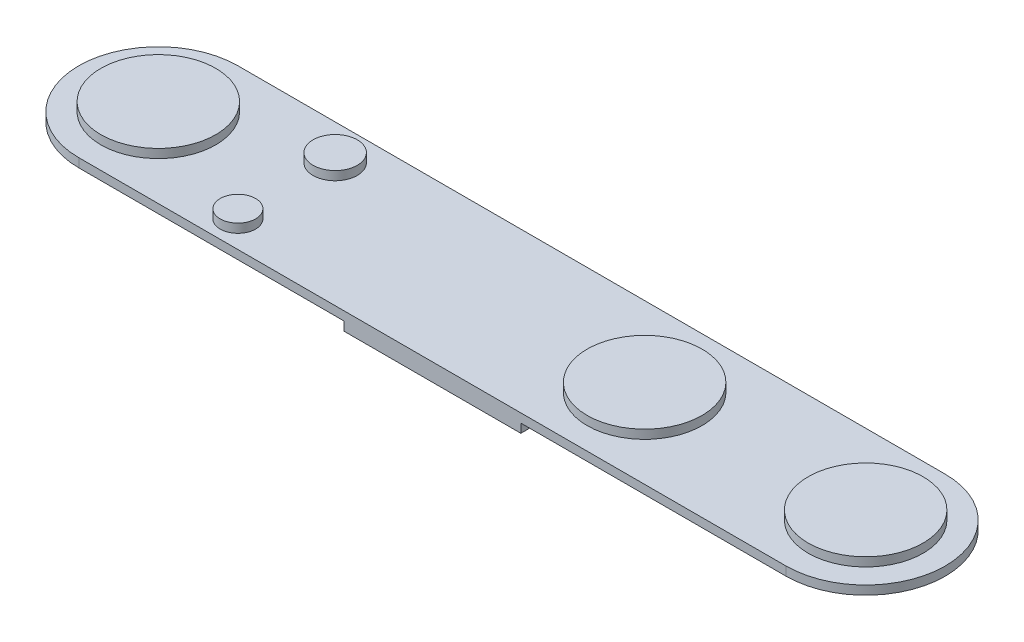
ISO-10303-21;
HEADER;
FILE_DESCRIPTION(('STEP AP214'),'2;1');
FILE_NAME('part.step','',(''),(''),'','','');
FILE_SCHEMA(('AUTOMOTIVE_DESIGN { 1 0 10303 214 1 1 1 1 }'));
ENDSEC;
DATA;
#1=APPLICATION_CONTEXT('core data for automotive mechanical design processes');
#2=APPLICATION_PROTOCOL_DEFINITION('international standard','automotive_design',2000,#1);
#3=PRODUCT_CONTEXT('',#1,'mechanical');
#4=PRODUCT('Part','Part','',(#3));
#5=PRODUCT_RELATED_PRODUCT_CATEGORY('part','',(#4));
#6=PRODUCT_DEFINITION_FORMATION('','',#4);
#7=PRODUCT_DEFINITION_CONTEXT('part definition',#1,'design');
#8=PRODUCT_DEFINITION('design','',#6,#7);
#9=PRODUCT_DEFINITION_SHAPE('','',#8);
#10=(LENGTH_UNIT() NAMED_UNIT(*) SI_UNIT(.MILLI.,.METRE.));
#11=(NAMED_UNIT(*) PLANE_ANGLE_UNIT() SI_UNIT($,.RADIAN.));
#12=(NAMED_UNIT(*) SI_UNIT($,.STERADIAN.) SOLID_ANGLE_UNIT());
#13=UNCERTAINTY_MEASURE_WITH_UNIT(LENGTH_MEASURE(1.E-05),#10,'distance_accuracy_value','');
#14=(GEOMETRIC_REPRESENTATION_CONTEXT(3) GLOBAL_UNCERTAINTY_ASSIGNED_CONTEXT((#13)) GLOBAL_UNIT_ASSIGNED_CONTEXT((#10,
#11,#12)) REPRESENTATION_CONTEXT('',''));
#15=CARTESIAN_POINT('',(0.,0.,0.));
#16=DIRECTION('',(0.,0.,1.));
#17=DIRECTION('',(1.,0.,0.));
#18=AXIS2_PLACEMENT_3D('',#15,#16,#17);
#19=CARTESIAN_POINT('',(-40.,0.,0.));
#20=DIRECTION('',(0.,1.,0.));
#21=DIRECTION('',(0.,0.,1.));
#22=AXIS2_PLACEMENT_3D('',#19,#20,#21);
#23=PLANE('',#22);
#24=DIRECTION('',(0.,0.,1.));
#25=VECTOR('',#24,1.);
#26=CARTESIAN_POINT('',(10.,0.,-9.));
#27=LINE('',#26,#25);
#28=CARTESIAN_POINT('',(10.,0.,-9.00000000000001));
#29=VERTEX_POINT('',#28);
#30=CARTESIAN_POINT('',(10.,0.,8.99999999999999));
#31=VERTEX_POINT('',#30);
#32=EDGE_CURVE('E132',#29,#31,#27,.T.);
#33=ORIENTED_EDGE('',*,*,#32,.F.);
#34=DIRECTION('',(-1.,0.,0.));
#35=VECTOR('',#34,1.);
#36=CARTESIAN_POINT('',(-40.,0.,-9.));
#37=LINE('',#36,#35);
#38=CARTESIAN_POINT('',(40.,0.,-9.00000000000002));
#39=VERTEX_POINT('',#38);
#40=EDGE_CURVE('E186',#39,#29,#37,.T.);
#41=ORIENTED_EDGE('',*,*,#40,.F.);
#42=CARTESIAN_POINT('',(40.,0.,0.));
#43=DIRECTION('',(0.,1.,0.));
#44=DIRECTION('',(0.,0.,1.));
#45=AXIS2_PLACEMENT_3D('',#42,#43,#44);
#46=CIRCLE('',#45,9.);
#47=CARTESIAN_POINT('',(40.,0.,9.));
#48=VERTEX_POINT('',#47);
#49=EDGE_CURVE('E202',#48,#39,#46,.T.);
#50=ORIENTED_EDGE('',*,*,#49,.F.);
#51=DIRECTION('',(1.,0.,0.));
#52=VECTOR('',#51,1.);
#53=CARTESIAN_POINT('',(-40.,0.,9.));
#54=LINE('',#53,#52);
#55=EDGE_CURVE('E59',#31,#48,#54,.T.);
#56=ORIENTED_EDGE('',*,*,#55,.F.);
#57=EDGE_LOOP('',(#33,#41,#50,#56));
#58=FACE_BOUND('',#57,.T.);
#59=ADVANCED_FACE('F43',(#58),#23,.F.);
#60=DIRECTION('',(0.,0.,-1.));
#61=VECTOR('',#60,1.);
#62=CARTESIAN_POINT('',(-10.,0.,-9.));
#63=LINE('',#62,#61);
#64=CARTESIAN_POINT('',(-10.,0.,9.));
#65=VERTEX_POINT('',#64);
#66=CARTESIAN_POINT('',(-10.,0.,-9.));
#67=VERTEX_POINT('',#66);
#68=EDGE_CURVE('E67',#65,#67,#63,.T.);
#69=ORIENTED_EDGE('',*,*,#68,.F.);
#70=CARTESIAN_POINT('',(-40.,0.,9.));
#71=VERTEX_POINT('',#70);
#72=EDGE_CURVE('E199',#71,#65,#54,.T.);
#73=ORIENTED_EDGE('',*,*,#72,.F.);
#74=CARTESIAN_POINT('',(-40.,0.,0.));
#75=DIRECTION('',(0.,1.,0.));
#76=DIRECTION('',(0.,0.,1.));
#77=AXIS2_PLACEMENT_3D('',#74,#75,#76);
#78=CIRCLE('',#77,9.);
#79=CARTESIAN_POINT('',(-40.,0.,-9.));
#80=VERTEX_POINT('',#79);
#81=EDGE_CURVE('E177',#80,#71,#78,.T.);
#82=ORIENTED_EDGE('',*,*,#81,.F.);
#83=EDGE_CURVE('E205',#67,#80,#37,.T.);
#84=ORIENTED_EDGE('',*,*,#83,.F.);
#85=EDGE_LOOP('',(#69,#73,#82,#84));
#86=FACE_BOUND('',#85,.T.);
#87=ADVANCED_FACE('F248',(#86),#23,.F.);
#88=CARTESIAN_POINT('',(-40.,1.,0.));
#89=DIRECTION('',(0.,-1.,0.));
#90=DIRECTION('',(0.,0.,-1.));
#91=AXIS2_PLACEMENT_3D('',#88,#89,#90);
#92=CYLINDRICAL_SURFACE('',#91,9.);
#93=ORIENTED_EDGE('',*,*,#81,.T.);
#94=DIRECTION('',(0.,-1.,0.));
#95=VECTOR('',#94,1.);
#96=CARTESIAN_POINT('',(-40.,1.,9.));
#97=LINE('',#96,#95);
#98=CARTESIAN_POINT('',(-40.,1.,9.));
#99=VERTEX_POINT('',#98);
#100=EDGE_CURVE('E11',#99,#71,#97,.T.);
#101=ORIENTED_EDGE('',*,*,#100,.F.);
#102=CARTESIAN_POINT('',(-40.,1.,0.));
#103=DIRECTION('',(0.,1.,0.));
#104=DIRECTION('',(0.,0.,1.));
#105=AXIS2_PLACEMENT_3D('',#102,#103,#104);
#106=CIRCLE('',#105,9.);
#107=CARTESIAN_POINT('',(-40.,1.,-9.));
#108=VERTEX_POINT('',#107);
#109=EDGE_CURVE('E181',#108,#99,#106,.T.);
#110=ORIENTED_EDGE('',*,*,#109,.F.);
#111=DIRECTION('',(0.,-1.,0.));
#112=VECTOR('',#111,1.);
#113=CARTESIAN_POINT('',(-40.,1.,-9.));
#114=LINE('',#113,#112);
#115=EDGE_CURVE('E195',#108,#80,#114,.T.);
#116=ORIENTED_EDGE('',*,*,#115,.T.);
#117=EDGE_LOOP('',(#93,#101,#110,#116));
#118=FACE_BOUND('',#117,.T.);
#119=ADVANCED_FACE('F45',(#118),#92,.T.);
#120=CARTESIAN_POINT('',(-40.,1.,9.));
#121=DIRECTION('',(0.,0.,-1.));
#122=DIRECTION('',(-1.,0.,0.));
#123=AXIS2_PLACEMENT_3D('',#120,#121,#122);
#124=PLANE('',#123);
#125=ORIENTED_EDGE('',*,*,#72,.T.);
#126=DIRECTION('',(0.,1.,0.));
#127=VECTOR('',#126,1.);
#128=CARTESIAN_POINT('',(-10.,-1.,9.));
#129=LINE('',#128,#127);
#130=CARTESIAN_POINT('',(-10.,-1.,9.));
#131=VERTEX_POINT('',#130);
#132=EDGE_CURVE('E115',#131,#65,#129,.T.);
#133=ORIENTED_EDGE('',*,*,#132,.F.);
#134=DIRECTION('',(-1.,0.,0.));
#135=VECTOR('',#134,1.);
#136=CARTESIAN_POINT('',(-10.,-1.,9.));
#137=LINE('',#136,#135);
#138=CARTESIAN_POINT('',(10.,-1.,9.));
#139=VERTEX_POINT('',#138);
#140=EDGE_CURVE('E108',#139,#131,#137,.T.);
#141=ORIENTED_EDGE('',*,*,#140,.F.);
#142=DIRECTION('',(0.,1.,0.));
#143=VECTOR('',#142,1.);
#144=CARTESIAN_POINT('',(10.,-1.,9.));
#145=LINE('',#144,#143);
#146=EDGE_CURVE('E112',#139,#31,#145,.T.);
#147=ORIENTED_EDGE('',*,*,#146,.T.);
#148=ORIENTED_EDGE('',*,*,#55,.T.);
#149=DIRECTION('',(0.,-1.,0.));
#150=VECTOR('',#149,1.);
#151=CARTESIAN_POINT('',(40.,1.,9.));
#152=LINE('',#151,#150);
#153=CARTESIAN_POINT('',(40.,1.,9.));
#154=VERTEX_POINT('',#153);
#155=EDGE_CURVE('E52',#154,#48,#152,.T.);
#156=ORIENTED_EDGE('',*,*,#155,.F.);
#157=DIRECTION('',(1.,0.,0.));
#158=VECTOR('',#157,1.);
#159=CARTESIAN_POINT('',(-40.,1.,9.));
#160=LINE('',#159,#158);
#161=EDGE_CURVE('E185',#99,#154,#160,.T.);
#162=ORIENTED_EDGE('',*,*,#161,.F.);
#163=ORIENTED_EDGE('',*,*,#100,.T.);
#164=EDGE_LOOP('',(#125,#133,#141,#147,#148,#156,#162,#163));
#165=FACE_BOUND('',#164,.T.);
#166=ADVANCED_FACE('F110',(#165),#124,.F.);
#167=CARTESIAN_POINT('',(40.,1.,0.));
#168=DIRECTION('',(0.,-1.,0.));
#169=DIRECTION('',(0.,0.,-1.));
#170=AXIS2_PLACEMENT_3D('',#167,#168,#169);
#171=CYLINDRICAL_SURFACE('',#170,9.);
#172=ORIENTED_EDGE('',*,*,#49,.T.);
#173=DIRECTION('',(0.,-1.,0.));
#174=VECTOR('',#173,1.);
#175=CARTESIAN_POINT('',(40.,1.,-9.00000000000002));
#176=LINE('',#175,#174);
#177=CARTESIAN_POINT('',(40.,1.,-9.00000000000002));
#178=VERTEX_POINT('',#177);
#179=EDGE_CURVE('E212',#178,#39,#176,.T.);
#180=ORIENTED_EDGE('',*,*,#179,.F.);
#181=CARTESIAN_POINT('',(40.,1.,0.));
#182=DIRECTION('',(0.,1.,0.));
#183=DIRECTION('',(0.,0.,1.));
#184=AXIS2_PLACEMENT_3D('',#181,#182,#183);
#185=CIRCLE('',#184,9.);
#186=EDGE_CURVE('E189',#154,#178,#185,.T.);
#187=ORIENTED_EDGE('',*,*,#186,.F.);
#188=ORIENTED_EDGE('',*,*,#155,.T.);
#189=EDGE_LOOP('',(#172,#180,#187,#188));
#190=FACE_BOUND('',#189,.T.);
#191=ADVANCED_FACE('F220',(#190),#171,.T.);
#192=CARTESIAN_POINT('',(-40.,1.,-9.));
#193=DIRECTION('',(0.,0.,1.));
#194=DIRECTION('',(1.,0.,0.));
#195=AXIS2_PLACEMENT_3D('',#192,#193,#194);
#196=PLANE('',#195);
#197=ORIENTED_EDGE('',*,*,#40,.T.);
#198=DIRECTION('',(0.,1.,0.));
#199=VECTOR('',#198,1.);
#200=CARTESIAN_POINT('',(10.,-1.,-9.));
#201=LINE('',#200,#199);
#202=CARTESIAN_POINT('',(10.,-1.,-9.));
#203=VERTEX_POINT('',#202);
#204=EDGE_CURVE('E225',#203,#29,#201,.T.);
#205=ORIENTED_EDGE('',*,*,#204,.F.);
#206=DIRECTION('',(1.,0.,0.));
#207=VECTOR('',#206,1.);
#208=CARTESIAN_POINT('',(-10.,-1.,-9.));
#209=LINE('',#208,#207);
#210=CARTESIAN_POINT('',(-10.,-1.,-9.));
#211=VERTEX_POINT('',#210);
#212=EDGE_CURVE('E125',#211,#203,#209,.T.);
#213=ORIENTED_EDGE('',*,*,#212,.F.);
#214=DIRECTION('',(0.,1.,0.));
#215=VECTOR('',#214,1.);
#216=CARTESIAN_POINT('',(-10.,-1.,-9.));
#217=LINE('',#216,#215);
#218=EDGE_CURVE('E141',#211,#67,#217,.T.);
#219=ORIENTED_EDGE('',*,*,#218,.T.);
#220=ORIENTED_EDGE('',*,*,#83,.T.);
#221=ORIENTED_EDGE('',*,*,#115,.F.);
#222=DIRECTION('',(-1.,0.,0.));
#223=VECTOR('',#222,1.);
#224=CARTESIAN_POINT('',(-40.,1.,-9.));
#225=LINE('',#224,#223);
#226=EDGE_CURVE('E192',#178,#108,#225,.T.);
#227=ORIENTED_EDGE('',*,*,#226,.F.);
#228=ORIENTED_EDGE('',*,*,#179,.T.);
#229=EDGE_LOOP('',(#197,#205,#213,#219,#220,#221,#227,#228));
#230=FACE_BOUND('',#229,.T.);
#231=ADVANCED_FACE('F224',(#230),#196,.F.);
#232=CARTESIAN_POINT('',(-40.,1.,0.));
#233=DIRECTION('',(0.,1.,0.));
#234=DIRECTION('',(0.,0.,1.));
#235=AXIS2_PLACEMENT_3D('',#232,#233,#234);
#236=PLANE('',#235);
#237=CARTESIAN_POINT('',(40.,1.,0.));
#238=DIRECTION('',(0.,1.,0.));
#239=DIRECTION('',(0.,0.,1.));
#240=AXIS2_PLACEMENT_3D('',#237,#238,#239);
#241=CIRCLE('',#240,6.5);
#242=CARTESIAN_POINT('',(40.,1.,6.5));
#243=VERTEX_POINT('',#242);
#244=EDGE_CURVE('E139',#243,#243,#241,.T.);
#245=ORIENTED_EDGE('',*,*,#244,.F.);
#246=EDGE_LOOP('',(#245));
#247=FACE_BOUND('',#246,.T.);
#248=CARTESIAN_POINT('',(-40.,1.,0.));
#249=DIRECTION('',(0.,1.,0.));
#250=DIRECTION('',(0.,0.,1.));
#251=AXIS2_PLACEMENT_3D('',#248,#249,#250);
#252=CIRCLE('',#251,6.5);
#253=CARTESIAN_POINT('',(-40.,1.,6.5));
#254=VERTEX_POINT('',#253);
#255=EDGE_CURVE('E149',#254,#254,#252,.T.);
#256=ORIENTED_EDGE('',*,*,#255,.F.);
#257=EDGE_LOOP('',(#256));
#258=FACE_BOUND('',#257,.T.);
#259=CARTESIAN_POINT('',(15.,1.,0.));
#260=DIRECTION('',(0.,1.,0.));
#261=DIRECTION('',(0.,0.,1.));
#262=AXIS2_PLACEMENT_3D('',#259,#260,#261);
#263=CIRCLE('',#262,6.5);
#264=CARTESIAN_POINT('',(15.,1.,6.5));
#265=VERTEX_POINT('',#264);
#266=EDGE_CURVE('E157',#265,#265,#263,.T.);
#267=ORIENTED_EDGE('',*,*,#266,.F.);
#268=EDGE_LOOP('',(#267));
#269=FACE_BOUND('',#268,.T.);
#270=CARTESIAN_POINT('',(-25.,1.,6.));
#271=DIRECTION('',(0.,1.,0.));
#272=DIRECTION('',(0.,0.,1.));
#273=AXIS2_PLACEMENT_3D('',#270,#271,#272);
#274=CIRCLE('',#273,2.);
#275=CARTESIAN_POINT('',(-25.,1.,8.00000000000001));
#276=VERTEX_POINT('',#275);
#277=EDGE_CURVE('E165',#276,#276,#274,.T.);
#278=ORIENTED_EDGE('',*,*,#277,.F.);
#279=EDGE_LOOP('',(#278));
#280=FACE_BOUND('',#279,.T.);
#281=CARTESIAN_POINT('',(-25.,1.,-5.00000000000002));
#282=DIRECTION('',(0.,1.,0.));
#283=DIRECTION('',(0.,0.,1.));
#284=AXIS2_PLACEMENT_3D('',#281,#282,#283);
#285=CIRCLE('',#284,2.5);
#286=CARTESIAN_POINT('',(-25.,1.,-2.50000000000002));
#287=VERTEX_POINT('',#286);
#288=EDGE_CURVE('E169',#287,#287,#285,.T.);
#289=ORIENTED_EDGE('',*,*,#288,.F.);
#290=EDGE_LOOP('',(#289));
#291=FACE_BOUND('',#290,.T.);
#292=ORIENTED_EDGE('',*,*,#109,.T.);
#293=ORIENTED_EDGE('',*,*,#161,.T.);
#294=ORIENTED_EDGE('',*,*,#186,.T.);
#295=ORIENTED_EDGE('',*,*,#226,.T.);
#296=EDGE_LOOP('',(#292,#293,#294,#295));
#297=FACE_BOUND('',#296,.T.);
#298=ADVANCED_FACE('F250',(#247,#258,#269,#280,#291,#297),#236,.T.);
#299=CARTESIAN_POINT('',(-25.,2.,-5.00000000000002));
#300=DIRECTION('',(0.,-1.,0.));
#301=DIRECTION('',(0.,0.,-1.));
#302=AXIS2_PLACEMENT_3D('',#299,#300,#301);
#303=CYLINDRICAL_SURFACE('',#302,2.5);
#304=CARTESIAN_POINT('',(-25.,2.,-5.00000000000002));
#305=DIRECTION('',(0.,1.,0.));
#306=DIRECTION('',(0.,0.,1.));
#307=AXIS2_PLACEMENT_3D('',#304,#305,#306);
#308=CIRCLE('',#307,2.5);
#309=CARTESIAN_POINT('',(-25.,2.,-2.50000000000002));
#310=VERTEX_POINT('',#309);
#311=EDGE_CURVE('E173',#310,#310,#308,.T.);
#312=ORIENTED_EDGE('',*,*,#311,.F.);
#313=EDGE_LOOP('',(#312));
#314=FACE_BOUND('',#313,.T.);
#315=ORIENTED_EDGE('',*,*,#288,.T.);
#316=EDGE_LOOP('',(#315));
#317=FACE_BOUND('',#316,.T.);
#318=ADVANCED_FACE('F252',(#314,#317),#303,.T.);
#319=CARTESIAN_POINT('',(-25.,2.,-5.00000000000002));
#320=DIRECTION('',(0.,1.,0.));
#321=DIRECTION('',(0.,0.,1.));
#322=AXIS2_PLACEMENT_3D('',#319,#320,#321);
#323=PLANE('',#322);
#324=ORIENTED_EDGE('',*,*,#311,.T.);
#325=EDGE_LOOP('',(#324));
#326=FACE_BOUND('',#325,.T.);
#327=ADVANCED_FACE('F259',(#326),#323,.T.);
#328=CARTESIAN_POINT('',(-25.,2.,6.));
#329=DIRECTION('',(0.,-1.,0.));
#330=DIRECTION('',(0.,0.,-1.));
#331=AXIS2_PLACEMENT_3D('',#328,#329,#330);
#332=CYLINDRICAL_SURFACE('',#331,2.);
#333=CARTESIAN_POINT('',(-25.,2.,6.));
#334=DIRECTION('',(0.,1.,0.));
#335=DIRECTION('',(0.,0.,1.));
#336=AXIS2_PLACEMENT_3D('',#333,#334,#335);
#337=CIRCLE('',#336,2.);
#338=CARTESIAN_POINT('',(-25.,2.,8.00000000000001));
#339=VERTEX_POINT('',#338);
#340=EDGE_CURVE('E161',#339,#339,#337,.T.);
#341=ORIENTED_EDGE('',*,*,#340,.F.);
#342=EDGE_LOOP('',(#341));
#343=FACE_BOUND('',#342,.T.);
#344=ORIENTED_EDGE('',*,*,#277,.T.);
#345=EDGE_LOOP('',(#344));
#346=FACE_BOUND('',#345,.T.);
#347=ADVANCED_FACE('F308',(#343,#346),#332,.T.);
#348=CARTESIAN_POINT('',(-25.,2.,6.));
#349=DIRECTION('',(0.,1.,0.));
#350=DIRECTION('',(0.,0.,1.));
#351=AXIS2_PLACEMENT_3D('',#348,#349,#350);
#352=PLANE('',#351);
#353=ORIENTED_EDGE('',*,*,#340,.T.);
#354=EDGE_LOOP('',(#353));
#355=FACE_BOUND('',#354,.T.);
#356=ADVANCED_FACE('F319',(#355),#352,.T.);
#357=CARTESIAN_POINT('',(15.,2.,0.));
#358=DIRECTION('',(0.,-1.,0.));
#359=DIRECTION('',(0.,0.,-1.));
#360=AXIS2_PLACEMENT_3D('',#357,#358,#359);
#361=CYLINDRICAL_SURFACE('',#360,6.5);
#362=CARTESIAN_POINT('',(15.,2.,0.));
#363=DIRECTION('',(0.,1.,0.));
#364=DIRECTION('',(0.,0.,1.));
#365=AXIS2_PLACEMENT_3D('',#362,#363,#364);
#366=CIRCLE('',#365,6.5);
#367=CARTESIAN_POINT('',(15.,2.,6.5));
#368=VERTEX_POINT('',#367);
#369=EDGE_CURVE('E153',#368,#368,#366,.T.);
#370=ORIENTED_EDGE('',*,*,#369,.F.);
#371=EDGE_LOOP('',(#370));
#372=FACE_BOUND('',#371,.T.);
#373=ORIENTED_EDGE('',*,*,#266,.T.);
#374=EDGE_LOOP('',(#373));
#375=FACE_BOUND('',#374,.T.);
#376=ADVANCED_FACE('F330',(#372,#375),#361,.T.);
#377=CARTESIAN_POINT('',(15.,2.,0.));
#378=DIRECTION('',(0.,1.,0.));
#379=DIRECTION('',(0.,0.,1.));
#380=AXIS2_PLACEMENT_3D('',#377,#378,#379);
#381=PLANE('',#380);
#382=ORIENTED_EDGE('',*,*,#369,.T.);
#383=EDGE_LOOP('',(#382));
#384=FACE_BOUND('',#383,.T.);
#385=ADVANCED_FACE('F341',(#384),#381,.T.);
#386=CARTESIAN_POINT('',(-40.,2.,0.));
#387=DIRECTION('',(0.,-1.,0.));
#388=DIRECTION('',(0.,0.,-1.));
#389=AXIS2_PLACEMENT_3D('',#386,#387,#388);
#390=CYLINDRICAL_SURFACE('',#389,6.5);
#391=CARTESIAN_POINT('',(-40.,2.,0.));
#392=DIRECTION('',(0.,1.,0.));
#393=DIRECTION('',(0.,0.,1.));
#394=AXIS2_PLACEMENT_3D('',#391,#392,#393);
#395=CIRCLE('',#394,6.5);
#396=CARTESIAN_POINT('',(-40.,2.,6.5));
#397=VERTEX_POINT('',#396);
#398=EDGE_CURVE('E147',#397,#397,#395,.T.);
#399=ORIENTED_EDGE('',*,*,#398,.F.);
#400=EDGE_LOOP('',(#399));
#401=FACE_BOUND('',#400,.T.);
#402=ORIENTED_EDGE('',*,*,#255,.T.);
#403=EDGE_LOOP('',(#402));
#404=FACE_BOUND('',#403,.T.);
#405=ADVANCED_FACE('F352',(#401,#404),#390,.T.);
#406=CARTESIAN_POINT('',(-40.,2.,0.));
#407=DIRECTION('',(0.,1.,0.));
#408=DIRECTION('',(0.,0.,1.));
#409=AXIS2_PLACEMENT_3D('',#406,#407,#408);
#410=PLANE('',#409);
#411=ORIENTED_EDGE('',*,*,#398,.T.);
#412=EDGE_LOOP('',(#411));
#413=FACE_BOUND('',#412,.T.);
#414=ADVANCED_FACE('F363',(#413),#410,.T.);
#415=CARTESIAN_POINT('',(40.,2.,0.));
#416=DIRECTION('',(0.,-1.,0.));
#417=DIRECTION('',(0.,0.,-1.));
#418=AXIS2_PLACEMENT_3D('',#415,#416,#417);
#419=CYLINDRICAL_SURFACE('',#418,6.5);
#420=CARTESIAN_POINT('',(40.,2.,0.));
#421=DIRECTION('',(0.,1.,0.));
#422=DIRECTION('',(0.,0.,1.));
#423=AXIS2_PLACEMENT_3D('',#420,#421,#422);
#424=CIRCLE('',#423,6.5);
#425=CARTESIAN_POINT('',(40.,2.,6.5));
#426=VERTEX_POINT('',#425);
#427=EDGE_CURVE('E134',#426,#426,#424,.T.);
#428=ORIENTED_EDGE('',*,*,#427,.F.);
#429=EDGE_LOOP('',(#428));
#430=FACE_BOUND('',#429,.T.);
#431=ORIENTED_EDGE('',*,*,#244,.T.);
#432=EDGE_LOOP('',(#431));
#433=FACE_BOUND('',#432,.T.);
#434=ADVANCED_FACE('F374',(#430,#433),#419,.T.);
#435=CARTESIAN_POINT('',(40.,2.,0.));
#436=DIRECTION('',(0.,1.,0.));
#437=DIRECTION('',(0.,0.,1.));
#438=AXIS2_PLACEMENT_3D('',#435,#436,#437);
#439=PLANE('',#438);
#440=ORIENTED_EDGE('',*,*,#427,.T.);
#441=EDGE_LOOP('',(#440));
#442=FACE_BOUND('',#441,.T.);
#443=ADVANCED_FACE('F384',(#442),#439,.T.);
#444=CARTESIAN_POINT('',(10.,-1.,-9.));
#445=DIRECTION('',(-1.,0.,0.));
#446=DIRECTION('',(0.,0.,1.));
#447=AXIS2_PLACEMENT_3D('',#444,#445,#446);
#448=PLANE('',#447);
#449=ORIENTED_EDGE('',*,*,#32,.T.);
#450=ORIENTED_EDGE('',*,*,#146,.F.);
#451=DIRECTION('',(0.,0.,1.));
#452=VECTOR('',#451,1.);
#453=CARTESIAN_POINT('',(10.,-1.,-9.));
#454=LINE('',#453,#452);
#455=EDGE_CURVE('E120',#203,#139,#454,.T.);
#456=ORIENTED_EDGE('',*,*,#455,.F.);
#457=ORIENTED_EDGE('',*,*,#204,.T.);
#458=EDGE_LOOP('',(#449,#450,#456,#457));
#459=FACE_BOUND('',#458,.T.);
#460=ADVANCED_FACE('F131',(#459),#448,.F.);
#461=CARTESIAN_POINT('',(-10.,-1.,-9.));
#462=DIRECTION('',(1.,0.,0.));
#463=DIRECTION('',(0.,0.,-1.));
#464=AXIS2_PLACEMENT_3D('',#461,#462,#463);
#465=PLANE('',#464);
#466=ORIENTED_EDGE('',*,*,#68,.T.);
#467=ORIENTED_EDGE('',*,*,#218,.F.);
#468=DIRECTION('',(0.,0.,-1.));
#469=VECTOR('',#468,1.);
#470=CARTESIAN_POINT('',(-10.,-1.,-9.));
#471=LINE('',#470,#469);
#472=EDGE_CURVE('E119',#131,#211,#471,.T.);
#473=ORIENTED_EDGE('',*,*,#472,.F.);
#474=ORIENTED_EDGE('',*,*,#132,.T.);
#475=EDGE_LOOP('',(#466,#467,#473,#474));
#476=FACE_BOUND('',#475,.T.);
#477=ADVANCED_FACE('F241',(#476),#465,.F.);
#478=CARTESIAN_POINT('',(0.,-1.,0.));
#479=DIRECTION('',(0.,1.,0.));
#480=DIRECTION('',(0.,0.,1.));
#481=AXIS2_PLACEMENT_3D('',#478,#479,#480);
#482=PLANE('',#481);
#483=ORIENTED_EDGE('',*,*,#455,.T.);
#484=ORIENTED_EDGE('',*,*,#140,.T.);
#485=ORIENTED_EDGE('',*,*,#472,.T.);
#486=ORIENTED_EDGE('',*,*,#212,.T.);
#487=EDGE_LOOP('',(#483,#484,#485,#486));
#488=FACE_BOUND('',#487,.T.);
#489=ADVANCED_FACE('F123',(#488),#482,.F.);
#490=CLOSED_SHELL('',(#59,#87,#119,#166,#191,#231,#298,#318,#327,#347,#356,#376,#385,#405,#414,
#434,#443,#460,#477,#489));
#491=MANIFOLD_SOLID_BREP('B2',#490);
#492=ADVANCED_BREP_SHAPE_REPRESENTATION('',(#18,#491),#14);
#493=SHAPE_DEFINITION_REPRESENTATION(#9,#492);
ENDSEC;
END-ISO-10303-21;
